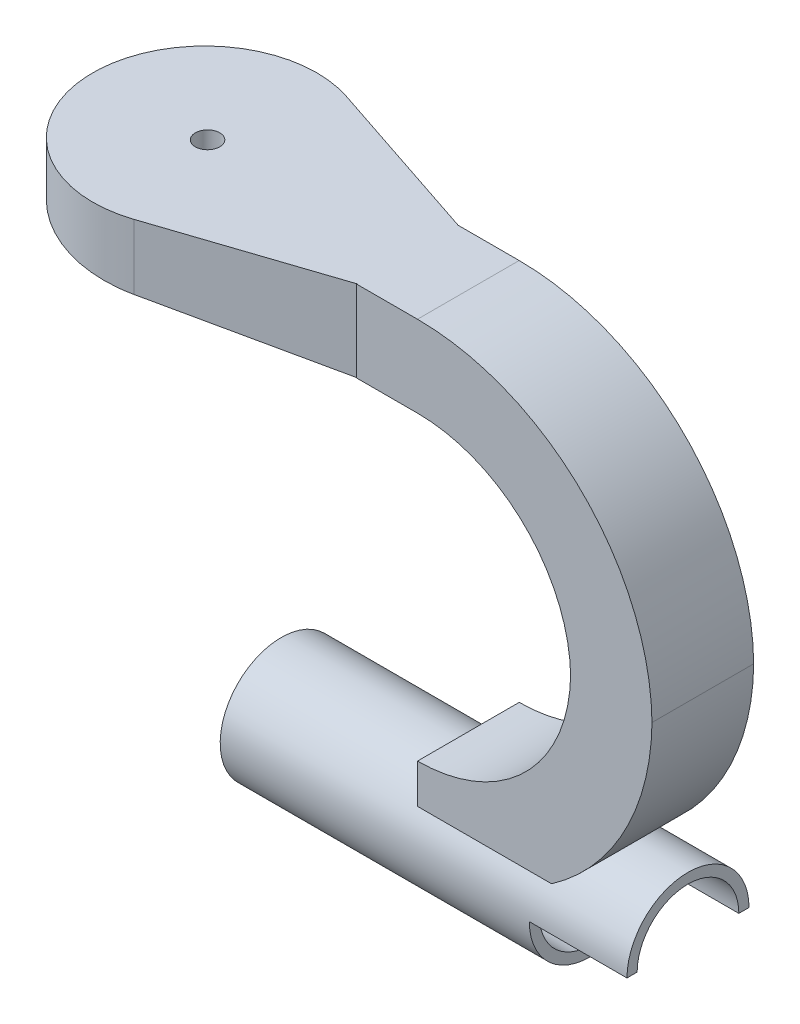
ISO-10303-21;
HEADER;
FILE_DESCRIPTION(('STEP AP214'),'2;1');
FILE_NAME('part.step','',(''),(''),'','','');
FILE_SCHEMA(('AUTOMOTIVE_DESIGN { 1 0 10303 214 1 1 1 1 }'));
ENDSEC;
DATA;
#1=APPLICATION_CONTEXT('core data for automotive mechanical design processes');
#2=APPLICATION_PROTOCOL_DEFINITION('international standard','automotive_design',2000,#1);
#3=PRODUCT_CONTEXT('',#1,'mechanical');
#4=PRODUCT('Part','Part','',(#3));
#5=PRODUCT_RELATED_PRODUCT_CATEGORY('part','',(#4));
#6=PRODUCT_DEFINITION_FORMATION('','',#4);
#7=PRODUCT_DEFINITION_CONTEXT('part definition',#1,'design');
#8=PRODUCT_DEFINITION('design','',#6,#7);
#9=PRODUCT_DEFINITION_SHAPE('','',#8);
#10=(LENGTH_UNIT() NAMED_UNIT(*) SI_UNIT(.MILLI.,.METRE.));
#11=(NAMED_UNIT(*) PLANE_ANGLE_UNIT() SI_UNIT($,.RADIAN.));
#12=(NAMED_UNIT(*) SI_UNIT($,.STERADIAN.) SOLID_ANGLE_UNIT());
#13=UNCERTAINTY_MEASURE_WITH_UNIT(LENGTH_MEASURE(1.E-05),#10,'distance_accuracy_value','');
#14=(GEOMETRIC_REPRESENTATION_CONTEXT(3) GLOBAL_UNCERTAINTY_ASSIGNED_CONTEXT((#13)) GLOBAL_UNIT_ASSIGNED_CONTEXT((#10,
#11,#12)) REPRESENTATION_CONTEXT('',''));
#15=CARTESIAN_POINT('',(0.,0.,0.));
#16=DIRECTION('',(0.,0.,1.));
#17=DIRECTION('',(1.,0.,0.));
#18=AXIS2_PLACEMENT_3D('',#15,#16,#17);
#19=CARTESIAN_POINT('',(21.9420967034581,-54.9667534375476,12.5));
#20=DIRECTION('',(-1.,0.,0.));
#21=DIRECTION('',(0.,-1.,0.));
#22=AXIS2_PLACEMENT_3D('',#19,#20,#21);
#23=CYLINDRICAL_SURFACE('',#22,15.);
#24=CARTESIAN_POINT('',(0.913116741093817,-46.6751914616591,25.));
#25=CARTESIAN_POINT('',(1.1138468792061,-46.5352621894275,24.9071761657905));
#26=CARTESIAN_POINT('',(1.3125251932372,-46.3948587290936,24.8106646041677));
#27=CARTESIAN_POINT('',(1.70552495605762,-46.1134360383374,24.6098592030103));
#28=CARTESIAN_POINT('',(1.89984559895508,-45.972416699685,24.505563939172));
#29=CARTESIAN_POINT('',(2.47655379689234,-45.5484436641558,24.1800092533691));
#30=CARTESIAN_POINT('',(2.85187772906759,-45.2651407554139,23.9464511631413));
#31=CARTESIAN_POINT('',(3.58404288105051,-44.6988301088567,23.441439431088));
#32=CARTESIAN_POINT('',(3.9406689634823,-44.4158520118274,23.1696394778224));
#33=CARTESIAN_POINT('',(4.62758378882239,-43.8580946270738,22.587611081909));
#34=CARTESIAN_POINT('',(4.95789716107535,-43.5833078265523,22.2774192864931));
#35=CARTESIAN_POINT('',(5.49809409527823,-43.1243351021247,21.7113675283263));
#36=CARTESIAN_POINT('',(5.71540088735002,-42.9367151326439,21.4653435944426));
#37=CARTESIAN_POINT('',(6.13300662272347,-42.5710308489494,20.9525266764477));
#38=CARTESIAN_POINT('',(6.33330558177778,-42.3929665258854,20.6857337115731));
#39=CARTESIAN_POINT('',(6.7145658915478,-42.0496191406402,20.1323868147486));
#40=CARTESIAN_POINT('',(6.89558377693458,-41.8842991276715,19.8458949492612));
#41=CARTESIAN_POINT('',(7.23718336341582,-41.5687021366347,19.253141280775));
#42=CARTESIAN_POINT('',(7.39776870576714,-41.4184224792662,18.9468830150244));
#43=CARTESIAN_POINT('',(7.69842642265187,-41.1342212507978,18.3123317698669));
#44=CARTESIAN_POINT('',(7.83825518907909,-41.0004966042071,17.9838343995868));
#45=CARTESIAN_POINT('',(8.0935559117688,-40.7542702904047,17.3097856201569));
#46=CARTESIAN_POINT('',(8.20902703881671,-40.6417693457318,16.9642336309053));
#47=CARTESIAN_POINT('',(8.41405052975016,-40.4406969032648,16.258749695868));
#48=CARTESIAN_POINT('',(8.50360400265006,-40.3521243815863,15.8988183661233));
#49=CARTESIAN_POINT('',(8.65549491296067,-40.2012023808026,15.1678954540618));
#50=CARTESIAN_POINT('',(8.71783750745595,-40.1388479328544,14.7969059817669));
#51=CARTESIAN_POINT('',(8.80727745227733,-40.0491600259839,14.1028834071157));
#52=CARTESIAN_POINT('',(8.83821130569222,-40.0180233208225,13.7808268853066));
#53=CARTESIAN_POINT('',(8.87927425660767,-39.9766596492437,13.1340682013829));
#54=CARTESIAN_POINT('',(8.88940568327445,-39.9664303419075,12.8093663395444));
#55=CARTESIAN_POINT('',(8.8887496838116,-39.9670919986047,12.1601716248539));
#56=CARTESIAN_POINT('',(8.87797255897424,-39.9779725621594,11.83567874783));
#57=CARTESIAN_POINT('',(8.83564392177306,-40.0206076922898,11.1894368967954));
#58=CARTESIAN_POINT('',(8.80409286274355,-40.0523618033575,10.867687863063));
#59=CARTESIAN_POINT('',(8.72365563988784,-40.133005148994,10.2530432420002));
#60=CARTESIAN_POINT('',(8.67621661293953,-40.1804608681874,9.95976724785307));
#61=CARTESIAN_POINT('',(8.56427612109732,-40.2919099310609,9.37971500891591));
#62=CARTESIAN_POINT('',(8.49977583851572,-40.3559021287875,9.0929383152313));
#63=CARTESIAN_POINT('',(8.35430221662937,-40.4993766982787,8.52758652821632));
#64=CARTESIAN_POINT('',(8.27332952328313,-40.5788584626214,8.24901111376652));
#65=CARTESIAN_POINT('',(8.09560918842098,-40.7520829684202,7.70149994927512));
#66=CARTESIAN_POINT('',(7.99886072146041,-40.8458264560833,7.43256470454019));
#67=CARTESIAN_POINT('',(7.78481578237042,-41.0515559935915,6.89148319986243));
#68=CARTESIAN_POINT('',(7.66669858406856,-41.1642483546731,6.61993072738686));
#69=CARTESIAN_POINT('',(7.41483619743397,-41.4022514086818,6.0899544746623));
#70=CARTESIAN_POINT('',(7.28109085908595,-41.5275622227324,5.83153082047167));
#71=CARTESIAN_POINT('',(6.99896033951464,-41.7891284184831,5.32848747475089));
#72=CARTESIAN_POINT('',(6.85057064067504,-41.9253871750728,5.08387207972268));
#73=CARTESIAN_POINT('',(6.54021794958831,-42.2071375972947,4.60896219467731));
#74=CARTESIAN_POINT('',(6.37825211688651,-42.3526311935245,4.37867071921562));
#75=CARTESIAN_POINT('',(5.96189951224132,-42.7221021426611,3.82675960069471));
#76=CARTESIAN_POINT('',(5.70013043080529,-42.9505574723256,3.51366484414893));
#77=CARTESIAN_POINT('',(5.15244088134756,-43.419208922037,2.91888690124005));
#78=CARTESIAN_POINT('',(4.86650936544589,-43.6594103914357,2.63721822200831));
#79=CARTESIAN_POINT('',(4.27294167759323,-44.1477048864956,2.10388754962242));
#80=CARTESIAN_POINT('',(3.96526644132582,-44.395811651897,1.85228186640155));
#81=CARTESIAN_POINT('',(3.33141358145914,-44.8957888068903,1.37820505892609));
#82=CARTESIAN_POINT('',(3.00524180262778,-45.1476579892603,1.1557248039695));
#83=CARTESIAN_POINT('',(2.38806282828078,-45.613396602158,0.770055997003427));
#84=CARTESIAN_POINT('',(2.0993591463197,-45.8271547411389,0.6030105245549));
#85=CARTESIAN_POINT('',(1.51297102917796,-46.2527207880682,0.287907136247227));
#86=CARTESIAN_POINT('',(1.21533845380558,-46.4645331072456,0.139758840673228));
#87=CARTESIAN_POINT('',(0.913116741093815,-46.6751914616591,0.));
#88=B_SPLINE_CURVE_WITH_KNOTS('',3,(#24,#25,#26,#27,#28,#29,#30,#31,#32,#33,#34,#35,#36,#37,#38,
#39,#40,#41,#42,#43,#44,#45,#46,#47,#48,#49,#50,#51,#52,#53,#54,#55,#56,#57,#58,#59,#60,#61,#62,
#63,#64,#65,#66,#67,#68,#69,#70,#71,#72,#73,#74,#75,#76,#77,#78,#79,#80,#81,#82,#83,#84,#85,#86,
#87),.UNSPECIFIED.,.F.,.F.,(4,2,2,2,2,2,2,2,2,2,2,2,2,2,2,2,2,2,2,2,2,2,2,2,2,2,2,2,2,2,2,4),
(0.,0.785044802826084,1.57023361124564,3.14376940723189,4.73260152196637,6.31992853535338,
7.45324798201158,8.58656637897864,9.71646453624466,10.8461610529694,11.9882153590478,
13.1303085381582,14.2723528399637,15.4141806041387,16.387983193098,17.3616767432498,
18.3348906927611,19.3080834052424,20.2096330909676,21.1111203173895,22.0125721991899,
22.9140712633074,23.8636527633375,24.8132433791969,25.7631278539802,26.7132115659628,
28.1141840634469,29.5158006351927,30.9200026834323,32.3237634605156,33.5117030621032,
34.6937291602976),.UNSPECIFIED.);
#89=CARTESIAN_POINT('',(0.913116741093817,-46.6751914616591,25.));
#90=VERTEX_POINT('',#89);
#91=CARTESIAN_POINT('',(0.913116741093824,-46.6751914616591,0.));
#92=VERTEX_POINT('',#91);
#93=EDGE_CURVE('E322',#90,#92,#88,.T.);
#94=ORIENTED_EDGE('',*,*,#93,.F.);
#95=DIRECTION('',(-1.,0.,0.));
#96=VECTOR('',#95,1.);
#97=CARTESIAN_POINT('',(21.9420967034581,-46.6751914616591,25.));
#98=LINE('',#97,#96);
#99=CARTESIAN_POINT('',(-32.0579032965419,-46.6751914616591,25.));
#100=VERTEX_POINT('',#99);
#101=EDGE_CURVE('E331',#90,#100,#98,.T.);
#102=ORIENTED_EDGE('',*,*,#101,.T.);
#103=CARTESIAN_POINT('',(-32.0579032965419,-54.9667534375476,12.5));
#104=DIRECTION('',(1.,0.,0.));
#105=DIRECTION('',(0.,1.,0.));
#106=AXIS2_PLACEMENT_3D('',#103,#104,#105);
#107=CIRCLE('',#106,15.);
#108=CARTESIAN_POINT('',(-32.0579032965419,-46.6751914616591,0.));
#109=VERTEX_POINT('',#108);
#110=EDGE_CURVE('E318',#109,#100,#107,.T.);
#111=ORIENTED_EDGE('',*,*,#110,.F.);
#112=DIRECTION('',(-1.,0.,0.));
#113=VECTOR('',#112,1.);
#114=CARTESIAN_POINT('',(21.9420967034581,-46.6751914616591,0.));
#115=LINE('',#114,#113);
#116=EDGE_CURVE('E456',#92,#109,#115,.T.);
#117=ORIENTED_EDGE('',*,*,#116,.F.);
#118=EDGE_LOOP('',(#94,#102,#111,#117));
#119=FACE_BOUND('',#118,.T.);
#120=CARTESIAN_POINT('',(-78.0579032965419,-54.9667534375476,12.5));
#121=DIRECTION('',(-1.,0.,0.));
#122=DIRECTION('',(0.,-1.,0.));
#123=AXIS2_PLACEMENT_3D('',#120,#121,#122);
#124=CIRCLE('',#123,15.);
#125=CARTESIAN_POINT('',(-78.0579032965419,-69.9667534375476,12.5));
#126=VERTEX_POINT('',#125);
#127=EDGE_CURVE('E307',#126,#126,#124,.T.);
#128=ORIENTED_EDGE('',*,*,#127,.F.);
#129=EDGE_LOOP('',(#128));
#130=FACE_BOUND('',#129,.T.);
#131=CARTESIAN_POINT('',(21.9420967034581,-54.9667534375476,12.5));
#132=DIRECTION('',(-1.,0.,0.));
#133=DIRECTION('',(0.,-1.,0.));
#134=AXIS2_PLACEMENT_3D('',#131,#132,#133);
#135=CIRCLE('',#134,15.);
#136=CARTESIAN_POINT('',(21.9420967034581,-54.9667534375476,27.5));
#137=VERTEX_POINT('',#136);
#138=CARTESIAN_POINT('',(21.9420967034581,-54.9667534375476,-2.49999999999999));
#139=VERTEX_POINT('',#138);
#140=EDGE_CURVE('E314',#137,#139,#135,.T.);
#141=ORIENTED_EDGE('',*,*,#140,.T.);
#142=DIRECTION('',(1.,0.,0.));
#143=VECTOR('',#142,1.);
#144=CARTESIAN_POINT('',(-2.05790329654187,-54.9667534375476,-2.49999999999999));
#145=LINE('',#144,#143);
#146=CARTESIAN_POINT('',(-2.05790329654187,-54.9667534375476,-2.49999999999999));
#147=VERTEX_POINT('',#146);
#148=EDGE_CURVE('E277',#147,#139,#145,.T.);
#149=ORIENTED_EDGE('',*,*,#148,.F.);
#150=CARTESIAN_POINT('',(-2.05790329654187,-54.9667534375476,12.5));
#151=DIRECTION('',(1.,0.,0.));
#152=DIRECTION('',(0.,1.,0.));
#153=AXIS2_PLACEMENT_3D('',#150,#151,#152);
#154=CIRCLE('',#153,15.);
#155=CARTESIAN_POINT('',(-2.05790329654187,-54.9667534375476,27.5));
#156=VERTEX_POINT('',#155);
#157=EDGE_CURVE('E260',#156,#147,#154,.T.);
#158=ORIENTED_EDGE('',*,*,#157,.F.);
#159=DIRECTION('',(1.,0.,0.));
#160=VECTOR('',#159,1.);
#161=CARTESIAN_POINT('',(-2.05790329654187,-54.9667534375476,27.5));
#162=LINE('',#161,#160);
#163=EDGE_CURVE('E280',#156,#137,#162,.T.);
#164=ORIENTED_EDGE('',*,*,#163,.T.);
#165=EDGE_LOOP('',(#141,#149,#158,#164));
#166=FACE_BOUND('',#165,.T.);
#167=ADVANCED_FACE('F41',(#119,#130,#166),#23,.T.);
#168=CARTESIAN_POINT('',(21.9420967034581,-54.9667534375476,12.5));
#169=DIRECTION('',(-1.,0.,0.));
#170=DIRECTION('',(0.,-1.,0.));
#171=AXIS2_PLACEMENT_3D('',#168,#169,#170);
#172=PLANE('',#171);
#173=DIRECTION('',(0.,0.,-1.));
#174=VECTOR('',#173,1.);
#175=CARTESIAN_POINT('',(21.9420967034581,-54.9667534375476,0.));
#176=LINE('',#175,#174);
#177=CARTESIAN_POINT('',(21.9420967034581,-54.9667534375476,0.));
#178=VERTEX_POINT('',#177);
#179=EDGE_CURVE('E256',#178,#139,#176,.T.);
#180=ORIENTED_EDGE('',*,*,#179,.T.);
#181=ORIENTED_EDGE('',*,*,#140,.F.);
#182=DIRECTION('',(0.,0.,1.));
#183=VECTOR('',#182,1.);
#184=CARTESIAN_POINT('',(21.9420967034581,-54.9667534375476,0.));
#185=LINE('',#184,#183);
#186=CARTESIAN_POINT('',(21.9420967034581,-54.9667534375476,25.));
#187=VERTEX_POINT('',#186);
#188=EDGE_CURVE('E268',#187,#137,#185,.T.);
#189=ORIENTED_EDGE('',*,*,#188,.F.);
#190=CARTESIAN_POINT('',(21.9420967034581,-54.9667534375476,12.5));
#191=DIRECTION('',(1.,0.,0.));
#192=DIRECTION('',(0.,1.,0.));
#193=AXIS2_PLACEMENT_3D('',#190,#191,#192);
#194=CIRCLE('',#193,12.5);
#195=EDGE_CURVE('E302',#178,#187,#194,.T.);
#196=ORIENTED_EDGE('',*,*,#195,.F.);
#197=EDGE_LOOP('',(#180,#181,#189,#196));
#198=FACE_BOUND('',#197,.T.);
#199=ADVANCED_FACE('F337',(#198),#172,.F.);
#200=CARTESIAN_POINT('',(-73.0579032965419,-54.9667534375476,12.5));
#201=DIRECTION('',(1.,0.,0.));
#202=DIRECTION('',(0.,1.,0.));
#203=AXIS2_PLACEMENT_3D('',#200,#201,#202);
#204=CYLINDRICAL_SURFACE('',#203,12.5);
#205=CARTESIAN_POINT('',(-73.0579032965419,-54.9667534375476,12.5));
#206=DIRECTION('',(1.,0.,0.));
#207=DIRECTION('',(0.,1.,0.));
#208=AXIS2_PLACEMENT_3D('',#205,#206,#207);
#209=CIRCLE('',#208,12.5);
#210=CARTESIAN_POINT('',(-73.0579032965419,-42.4667534375476,12.5));
#211=VERTEX_POINT('',#210);
#212=EDGE_CURVE('E303',#211,#211,#209,.T.);
#213=ORIENTED_EDGE('',*,*,#212,.F.);
#214=EDGE_LOOP('',(#213));
#215=FACE_BOUND('',#214,.T.);
#216=DIRECTION('',(1.,0.,0.));
#217=VECTOR('',#216,1.);
#218=CARTESIAN_POINT('',(-2.05790329654187,-54.9667534375476,0.));
#219=LINE('',#218,#217);
#220=CARTESIAN_POINT('',(-2.05790329654187,-54.9667534375476,0.));
#221=VERTEX_POINT('',#220);
#222=EDGE_CURVE('E67',#221,#178,#219,.T.);
#223=ORIENTED_EDGE('',*,*,#222,.T.);
#224=ORIENTED_EDGE('',*,*,#195,.T.);
#225=DIRECTION('',(1.,0.,0.));
#226=VECTOR('',#225,1.);
#227=CARTESIAN_POINT('',(-2.05790329654187,-54.9667534375476,25.));
#228=LINE('',#227,#226);
#229=CARTESIAN_POINT('',(-2.05790329654187,-54.9667534375476,25.));
#230=VERTEX_POINT('',#229);
#231=EDGE_CURVE('E267',#230,#187,#228,.T.);
#232=ORIENTED_EDGE('',*,*,#231,.F.);
#233=CARTESIAN_POINT('',(-2.05790329654187,-54.9667534375476,12.5));
#234=DIRECTION('',(1.,0.,0.));
#235=DIRECTION('',(0.,1.,0.));
#236=AXIS2_PLACEMENT_3D('',#233,#234,#235);
#237=CIRCLE('',#236,12.5);
#238=EDGE_CURVE('E251',#230,#221,#237,.T.);
#239=ORIENTED_EDGE('',*,*,#238,.T.);
#240=EDGE_LOOP('',(#223,#224,#232,#239));
#241=FACE_BOUND('',#240,.T.);
#242=ADVANCED_FACE('F381',(#215,#241),#204,.F.);
#243=CARTESIAN_POINT('',(-47.0579032965419,0.,25.));
#244=DIRECTION('',(1.,0.,0.));
#245=DIRECTION('',(0.,0.,-1.));
#246=AXIS2_PLACEMENT_3D('',#243,#244,#245);
#247=PLANE('',#246);
#248=DIRECTION('',(0.,1.,0.));
#249=VECTOR('',#248,1.);
#250=CARTESIAN_POINT('',(-47.0579032965419,37.0332465624524,24.9012426426025));
#251=LINE('',#250,#249);
#252=CARTESIAN_POINT('',(-47.0579032965419,37.0332465624524,24.9012426426025));
#253=VERTEX_POINT('',#252);
#254=CARTESIAN_POINT('',(-47.0579032965419,57.0332465624524,24.9012426426025));
#255=VERTEX_POINT('',#254);
#256=EDGE_CURVE('E411',#253,#255,#251,.T.);
#257=ORIENTED_EDGE('',*,*,#256,.F.);
#258=DIRECTION('',(0.,0.,-1.));
#259=VECTOR('',#258,1.);
#260=CARTESIAN_POINT('',(-47.0579032965419,37.0332465624524,25.));
#261=LINE('',#260,#259);
#262=CARTESIAN_POINT('',(-47.0579032965419,37.0332465624524,25.));
#263=VERTEX_POINT('',#262);
#264=EDGE_CURVE('E445',#263,#253,#261,.T.);
#265=ORIENTED_EDGE('',*,*,#264,.F.);
#266=DIRECTION('',(0.,-1.,0.));
#267=VECTOR('',#266,1.);
#268=CARTESIAN_POINT('',(-47.0579032965419,0.,25.));
#269=LINE('',#268,#267);
#270=CARTESIAN_POINT('',(-47.0579032965419,57.0332465624524,25.));
#271=VERTEX_POINT('',#270);
#272=EDGE_CURVE('E801',#271,#263,#269,.T.);
#273=ORIENTED_EDGE('',*,*,#272,.F.);
#274=DIRECTION('',(0.,0.,-1.));
#275=VECTOR('',#274,1.);
#276=CARTESIAN_POINT('',(-47.0579032965419,57.0332465624524,25.));
#277=LINE('',#276,#275);
#278=EDGE_CURVE('E449',#271,#255,#277,.T.);
#279=ORIENTED_EDGE('',*,*,#278,.T.);
#280=EDGE_LOOP('',(#257,#265,#273,#279));
#281=FACE_BOUND('',#280,.T.);
#282=ADVANCED_FACE('F378',(#281),#247,.F.);
#283=CARTESIAN_POINT('',(-32.0579032965419,0.621277195669455,25.));
#284=DIRECTION('',(0.,0.,-1.));
#285=DIRECTION('',(-1.,0.,0.));
#286=AXIS2_PLACEMENT_3D('',#283,#284,#285);
#287=CYLINDRICAL_SURFACE('',#286,57.6545237581219);
#288=CARTESIAN_POINT('',(-32.0579032965419,0.621277195669455,25.));
#289=DIRECTION('',(0.,0.,1.));
#290=DIRECTION('',(1.,0.,0.));
#291=AXIS2_PLACEMENT_3D('',#288,#289,#290);
#292=CIRCLE('',#291,57.6545237581219);
#293=CARTESIAN_POINT('',(25.5932729657165,0.,25.));
#294=VERTEX_POINT('',#293);
#295=EDGE_CURVE('E434',#90,#294,#292,.T.);
#296=ORIENTED_EDGE('',*,*,#295,.F.);
#297=ORIENTED_EDGE('',*,*,#93,.T.);
#298=CARTESIAN_POINT('',(-32.0579032965419,0.621277195669455,0.));
#299=DIRECTION('',(0.,0.,1.));
#300=DIRECTION('',(1.,0.,0.));
#301=AXIS2_PLACEMENT_3D('',#298,#299,#300);
#302=CIRCLE('',#301,57.6545237581219);
#303=CARTESIAN_POINT('',(25.5932729657165,0.,0.));
#304=VERTEX_POINT('',#303);
#305=EDGE_CURVE('E405',#92,#304,#302,.T.);
#306=ORIENTED_EDGE('',*,*,#305,.T.);
#307=DIRECTION('',(0.,0.,-1.));
#308=VECTOR('',#307,1.);
#309=CARTESIAN_POINT('',(25.5932729657165,0.,25.));
#310=LINE('',#309,#308);
#311=EDGE_CURVE('E400',#294,#304,#310,.T.);
#312=ORIENTED_EDGE('',*,*,#311,.F.);
#313=EDGE_LOOP('',(#296,#297,#306,#312));
#314=FACE_BOUND('',#313,.T.);
#315=ADVANCED_FACE('F43',(#314),#287,.T.);
#316=CARTESIAN_POINT('',(-32.0579032965419,-0.621277195669455,25.));
#317=DIRECTION('',(0.,0.,-1.));
#318=DIRECTION('',(-1.,0.,0.));
#319=AXIS2_PLACEMENT_3D('',#316,#317,#318);
#320=CYLINDRICAL_SURFACE('',#319,57.6545237581219);
#321=CARTESIAN_POINT('',(-32.0579032965419,-0.621277195669455,0.));
#322=DIRECTION('',(0.,0.,1.));
#323=DIRECTION('',(1.,0.,0.));
#324=AXIS2_PLACEMENT_3D('',#321,#322,#323);
#325=CIRCLE('',#324,57.6545237581219);
#326=CARTESIAN_POINT('',(-32.0579032965419,57.0332465624524,0.));
#327=VERTEX_POINT('',#326);
#328=EDGE_CURVE('E395',#327,#304,#325,.F.);
#329=ORIENTED_EDGE('',*,*,#328,.F.);
#330=DIRECTION('',(0.,0.,-1.));
#331=VECTOR('',#330,1.);
#332=CARTESIAN_POINT('',(-32.0579032965419,57.0332465624524,25.));
#333=LINE('',#332,#331);
#334=CARTESIAN_POINT('',(-32.0579032965419,57.0332465624524,25.));
#335=VERTEX_POINT('',#334);
#336=EDGE_CURVE('E397',#335,#327,#333,.T.);
#337=ORIENTED_EDGE('',*,*,#336,.F.);
#338=CARTESIAN_POINT('',(-32.0579032965419,-0.621277195669455,25.));
#339=DIRECTION('',(0.,0.,1.));
#340=DIRECTION('',(1.,0.,0.));
#341=AXIS2_PLACEMENT_3D('',#338,#339,#340);
#342=CIRCLE('',#341,57.6545237581219);
#343=EDGE_CURVE('E795',#335,#294,#342,.F.);
#344=ORIENTED_EDGE('',*,*,#343,.T.);
#345=ORIENTED_EDGE('',*,*,#311,.T.);
#346=EDGE_LOOP('',(#329,#337,#344,#345));
#347=FACE_BOUND('',#346,.T.);
#348=ADVANCED_FACE('F384',(#347),#320,.T.);
#349=CARTESIAN_POINT('',(0.,57.0332465624524,25.));
#350=DIRECTION('',(0.,-1.,0.));
#351=DIRECTION('',(0.,0.,-1.));
#352=AXIS2_PLACEMENT_3D('',#349,#350,#351);
#353=PLANE('',#352);
#354=CARTESIAN_POINT('',(-96.0521930019734,57.0332465624524,12.6061021043496));
#355=DIRECTION('',(0.,1.,0.));
#356=DIRECTION('',(0.,0.,1.));
#357=AXIS2_PLACEMENT_3D('',#354,#355,#356);
#358=CIRCLE('',#357,3.00000000000001);
#359=CARTESIAN_POINT('',(-96.0521930019734,57.0332465624524,15.6061021043496));
#360=VERTEX_POINT('',#359);
#361=EDGE_CURVE('E298',#360,#360,#358,.T.);
#362=ORIENTED_EDGE('',*,*,#361,.F.);
#363=EDGE_LOOP('',(#362));
#364=FACE_BOUND('',#363,.T.);
#365=DIRECTION('',(-1.,0.,0.));
#366=VECTOR('',#365,1.);
#367=CARTESIAN_POINT('',(0.,57.0332465624524,0.));
#368=LINE('',#367,#366);
#369=CARTESIAN_POINT('',(-47.0579032965419,57.0332465624524,0.));
#370=VERTEX_POINT('',#369);
#371=EDGE_CURVE('E404',#327,#370,#368,.T.);
#372=ORIENTED_EDGE('',*,*,#371,.T.);
#373=DIRECTION('',(-0.948821293671373,0.,-0.315813477666458));
#374=VECTOR('',#373,1.);
#375=CARTESIAN_POINT('',(-47.0579032965419,57.0332465624524,0.));
#376=LINE('',#375,#374);
#377=CARTESIAN_POINT('',(-88.1888610392089,57.0332465624524,-13.6903660268851));
#378=VERTEX_POINT('',#377);
#379=EDGE_CURVE('E768',#370,#378,#376,.T.);
#380=ORIENTED_EDGE('',*,*,#379,.T.);
#381=CARTESIAN_POINT('',(-96.8898421187134,57.0332465624524,12.4506213213013));
#382=DIRECTION('',(0.,1.,0.));
#383=DIRECTION('',(0.,0.,1.));
#384=AXIS2_PLACEMENT_3D('',#381,#382,#383);
#385=CIRCLE('',#384,27.5510125273816);
#386=CARTESIAN_POINT('',(-88.1888610392089,57.0332465624524,38.5916086694876));
#387=VERTEX_POINT('',#386);
#388=EDGE_CURVE('E776',#378,#387,#385,.T.);
#389=ORIENTED_EDGE('',*,*,#388,.T.);
#390=DIRECTION('',(0.948821293671373,0.,-0.315813477666457));
#391=VECTOR('',#390,1.);
#392=CARTESIAN_POINT('',(-88.1888610392089,57.0332465624524,38.5916086694876));
#393=LINE('',#392,#391);
#394=EDGE_CURVE('E779',#387,#255,#393,.T.);
#395=ORIENTED_EDGE('',*,*,#394,.T.);
#396=ORIENTED_EDGE('',*,*,#278,.F.);
#397=DIRECTION('',(-1.,0.,0.));
#398=VECTOR('',#397,1.);
#399=CARTESIAN_POINT('',(0.,57.0332465624524,25.));
#400=LINE('',#399,#398);
#401=EDGE_CURVE('E798',#335,#271,#400,.T.);
#402=ORIENTED_EDGE('',*,*,#401,.F.);
#403=ORIENTED_EDGE('',*,*,#336,.T.);
#404=EDGE_LOOP('',(#372,#380,#389,#395,#396,#402,#403));
#405=FACE_BOUND('',#404,.T.);
#406=ADVANCED_FACE('F376',(#364,#405),#353,.F.);
#407=CARTESIAN_POINT('',(0.,37.0332465624524,25.));
#408=DIRECTION('',(0.,-1.,0.));
#409=DIRECTION('',(1.,0.,0.));
#410=AXIS2_PLACEMENT_3D('',#407,#408,#409);
#411=PLANE('',#410);
#412=DIRECTION('',(0.,0.,1.));
#413=VECTOR('',#412,1.);
#414=CARTESIAN_POINT('',(-47.0579032965419,37.0332465624524,-15.1003912060803));
#415=LINE('',#414,#413);
#416=CARTESIAN_POINT('',(-47.0579032965419,37.0332465624524,0.));
#417=VERTEX_POINT('',#416);
#418=EDGE_CURVE('E276',#417,#253,#415,.T.);
#419=ORIENTED_EDGE('',*,*,#418,.F.);
#420=DIRECTION('',(-1.,0.,0.));
#421=VECTOR('',#420,1.);
#422=CARTESIAN_POINT('',(0.,37.0332465624524,0.));
#423=LINE('',#422,#421);
#424=CARTESIAN_POINT('',(-32.0579032965419,37.0332465624524,0.));
#425=VERTEX_POINT('',#424);
#426=EDGE_CURVE('E418',#425,#417,#423,.T.);
#427=ORIENTED_EDGE('',*,*,#426,.F.);
#428=DIRECTION('',(0.,0.,-1.));
#429=VECTOR('',#428,1.);
#430=CARTESIAN_POINT('',(-32.0579032965419,37.0332465624524,25.));
#431=LINE('',#430,#429);
#432=CARTESIAN_POINT('',(-32.0579032965419,37.0332465624524,25.));
#433=VERTEX_POINT('',#432);
#434=EDGE_CURVE('E442',#433,#425,#431,.T.);
#435=ORIENTED_EDGE('',*,*,#434,.F.);
#436=DIRECTION('',(-1.,0.,0.));
#437=VECTOR('',#436,1.);
#438=CARTESIAN_POINT('',(0.,37.0332465624524,25.));
#439=LINE('',#438,#437);
#440=EDGE_CURVE('E804',#433,#263,#439,.T.);
#441=ORIENTED_EDGE('',*,*,#440,.T.);
#442=ORIENTED_EDGE('',*,*,#264,.T.);
#443=EDGE_LOOP('',(#419,#427,#435,#441,#442));
#444=FACE_BOUND('',#443,.T.);
#445=ADVANCED_FACE('F372',(#444),#411,.T.);
#446=CARTESIAN_POINT('',(-32.0579032965419,-0.621277195669455,25.));
#447=DIRECTION('',(0.,0.,-1.));
#448=DIRECTION('',(-1.,0.,0.));
#449=AXIS2_PLACEMENT_3D('',#446,#447,#448);
#450=CYLINDRICAL_SURFACE('',#449,37.6545237581219);
#451=CARTESIAN_POINT('',(-32.0579032965419,-0.621277195669455,0.));
#452=DIRECTION('',(0.,0.,1.));
#453=DIRECTION('',(1.,0.,0.));
#454=AXIS2_PLACEMENT_3D('',#451,#452,#453);
#455=CIRCLE('',#454,37.6545237581219);
#456=CARTESIAN_POINT('',(5.59149476102478,0.,0.));
#457=VERTEX_POINT('',#456);
#458=EDGE_CURVE('E422',#425,#457,#455,.F.);
#459=ORIENTED_EDGE('',*,*,#458,.T.);
#460=DIRECTION('',(0.,0.,-1.));
#461=VECTOR('',#460,1.);
#462=CARTESIAN_POINT('',(5.59149476102478,0.,25.));
#463=LINE('',#462,#461);
#464=CARTESIAN_POINT('',(5.59149476102478,0.,25.));
#465=VERTEX_POINT('',#464);
#466=EDGE_CURVE('E438',#465,#457,#463,.T.);
#467=ORIENTED_EDGE('',*,*,#466,.F.);
#468=CARTESIAN_POINT('',(-32.0579032965419,-0.621277195669455,25.));
#469=DIRECTION('',(0.,0.,1.));
#470=DIRECTION('',(1.,0.,0.));
#471=AXIS2_PLACEMENT_3D('',#468,#469,#470);
#472=CIRCLE('',#471,37.6545237581219);
#473=EDGE_CURVE('E808',#433,#465,#472,.F.);
#474=ORIENTED_EDGE('',*,*,#473,.F.);
#475=ORIENTED_EDGE('',*,*,#434,.T.);
#476=EDGE_LOOP('',(#459,#467,#474,#475));
#477=FACE_BOUND('',#476,.T.);
#478=ADVANCED_FACE('F368',(#477),#450,.F.);
#479=CARTESIAN_POINT('',(-32.0579032965419,0.621277195669455,25.));
#480=DIRECTION('',(0.,0.,-1.));
#481=DIRECTION('',(-1.,0.,0.));
#482=AXIS2_PLACEMENT_3D('',#479,#480,#481);
#483=CYLINDRICAL_SURFACE('',#482,37.6545237581219);
#484=CARTESIAN_POINT('',(-32.0579032965419,0.621277195669455,0.));
#485=DIRECTION('',(0.,0.,1.));
#486=DIRECTION('',(1.,0.,0.));
#487=AXIS2_PLACEMENT_3D('',#484,#485,#486);
#488=CIRCLE('',#487,37.6545237581219);
#489=CARTESIAN_POINT('',(-32.0579032965419,-37.0332465624524,0.));
#490=VERTEX_POINT('',#489);
#491=EDGE_CURVE('E426',#490,#457,#488,.T.);
#492=ORIENTED_EDGE('',*,*,#491,.F.);
#493=DIRECTION('',(0.,0.,-1.));
#494=VECTOR('',#493,1.);
#495=CARTESIAN_POINT('',(-32.0579032965419,-37.0332465624524,25.));
#496=LINE('',#495,#494);
#497=CARTESIAN_POINT('',(-32.0579032965419,-37.0332465624524,25.));
#498=VERTEX_POINT('',#497);
#499=EDGE_CURVE('E435',#498,#490,#496,.T.);
#500=ORIENTED_EDGE('',*,*,#499,.F.);
#501=CARTESIAN_POINT('',(-32.0579032965419,0.621277195669455,25.));
#502=DIRECTION('',(0.,0.,1.));
#503=DIRECTION('',(1.,0.,0.));
#504=AXIS2_PLACEMENT_3D('',#501,#502,#503);
#505=CIRCLE('',#504,37.6545237581219);
#506=EDGE_CURVE('E811',#498,#465,#505,.T.);
#507=ORIENTED_EDGE('',*,*,#506,.T.);
#508=ORIENTED_EDGE('',*,*,#466,.T.);
#509=EDGE_LOOP('',(#492,#500,#507,#508));
#510=FACE_BOUND('',#509,.T.);
#511=ADVANCED_FACE('F364',(#510),#483,.F.);
#512=CARTESIAN_POINT('',(-32.0579032965419,0.,25.));
#513=DIRECTION('',(1.,0.,0.));
#514=DIRECTION('',(0.,1.,0.));
#515=AXIS2_PLACEMENT_3D('',#512,#513,#514);
#516=PLANE('',#515);
#517=DIRECTION('',(0.,-1.,0.));
#518=VECTOR('',#517,1.);
#519=CARTESIAN_POINT('',(-32.0579032965419,0.,0.));
#520=LINE('',#519,#518);
#521=EDGE_CURVE('E430',#490,#109,#520,.T.);
#522=ORIENTED_EDGE('',*,*,#521,.T.);
#523=ORIENTED_EDGE('',*,*,#110,.T.);
#524=DIRECTION('',(0.,-1.,0.));
#525=VECTOR('',#524,1.);
#526=CARTESIAN_POINT('',(-32.0579032965419,0.,25.));
#527=LINE('',#526,#525);
#528=EDGE_CURVE('E439',#498,#100,#527,.T.);
#529=ORIENTED_EDGE('',*,*,#528,.F.);
#530=ORIENTED_EDGE('',*,*,#499,.T.);
#531=EDGE_LOOP('',(#522,#523,#529,#530));
#532=FACE_BOUND('',#531,.T.);
#533=ADVANCED_FACE('F357',(#532),#516,.F.);
#534=CARTESIAN_POINT('',(0.,0.,25.));
#535=DIRECTION('',(0.,0.,1.));
#536=DIRECTION('',(1.,0.,0.));
#537=AXIS2_PLACEMENT_3D('',#534,#535,#536);
#538=PLANE('',#537);
#539=ORIENTED_EDGE('',*,*,#101,.F.);
#540=ORIENTED_EDGE('',*,*,#295,.T.);
#541=ORIENTED_EDGE('',*,*,#343,.F.);
#542=ORIENTED_EDGE('',*,*,#401,.T.);
#543=ORIENTED_EDGE('',*,*,#272,.T.);
#544=ORIENTED_EDGE('',*,*,#440,.F.);
#545=ORIENTED_EDGE('',*,*,#473,.T.);
#546=ORIENTED_EDGE('',*,*,#506,.F.);
#547=ORIENTED_EDGE('',*,*,#528,.T.);
#548=EDGE_LOOP('',(#539,#540,#541,#542,#543,#544,#545,#546,#547));
#549=FACE_BOUND('',#548,.T.);
#550=ADVANCED_FACE('F354',(#549),#538,.T.);
#551=CARTESIAN_POINT('',(0.,0.,0.));
#552=DIRECTION('',(0.,0.,1.));
#553=DIRECTION('',(1.,0.,0.));
#554=AXIS2_PLACEMENT_3D('',#551,#552,#553);
#555=PLANE('',#554);
#556=ORIENTED_EDGE('',*,*,#305,.F.);
#557=ORIENTED_EDGE('',*,*,#116,.T.);
#558=ORIENTED_EDGE('',*,*,#521,.F.);
#559=ORIENTED_EDGE('',*,*,#491,.T.);
#560=ORIENTED_EDGE('',*,*,#458,.F.);
#561=ORIENTED_EDGE('',*,*,#426,.T.);
#562=DIRECTION('',(0.,-1.,0.));
#563=VECTOR('',#562,1.);
#564=CARTESIAN_POINT('',(-47.0579032965419,0.,0.));
#565=LINE('',#564,#563);
#566=EDGE_CURVE('E409',#370,#417,#565,.T.);
#567=ORIENTED_EDGE('',*,*,#566,.F.);
#568=ORIENTED_EDGE('',*,*,#371,.F.);
#569=ORIENTED_EDGE('',*,*,#328,.T.);
#570=EDGE_LOOP('',(#556,#557,#558,#559,#560,#561,#567,#568,#569));
#571=FACE_BOUND('',#570,.T.);
#572=ADVANCED_FACE('F352',(#571),#555,.F.);
#573=CARTESIAN_POINT('',(-47.0579032965419,37.0332465624524,0.));
#574=DIRECTION('',(0.315813477666458,0.,-0.948821293671373));
#575=DIRECTION('',(-0.948821293671373,0.,-0.315813477666457));
#576=AXIS2_PLACEMENT_3D('',#573,#574,#575);
#577=PLANE('',#576);
#578=DIRECTION('',(0.944793800143109,-0.0920404760541468,0.314472933618886));
#579=VECTOR('',#578,1.);
#580=CARTESIAN_POINT('',(-47.0579032965419,37.0332465624524,0.));
#581=LINE('',#580,#579);
#582=CARTESIAN_POINT('',(-88.1888610392089,41.0401663058129,-13.6903660268851));
#583=VERTEX_POINT('',#582);
#584=EDGE_CURVE('E292',#583,#417,#581,.T.);
#585=ORIENTED_EDGE('',*,*,#584,.F.);
#586=DIRECTION('',(0.,1.,0.));
#587=VECTOR('',#586,1.);
#588=CARTESIAN_POINT('',(-88.1888610392089,37.0332465624524,-13.6903660268851));
#589=LINE('',#588,#587);
#590=EDGE_CURVE('E773',#583,#378,#589,.T.);
#591=ORIENTED_EDGE('',*,*,#590,.T.);
#592=ORIENTED_EDGE('',*,*,#379,.F.);
#593=ORIENTED_EDGE('',*,*,#566,.T.);
#594=EDGE_LOOP('',(#585,#591,#592,#593));
#595=FACE_BOUND('',#594,.T.);
#596=ADVANCED_FACE('F344',(#595),#577,.T.);
#597=CARTESIAN_POINT('',(-88.1888610392089,37.0332465624524,38.5916086694876));
#598=DIRECTION('',(0.315813477666457,0.,0.948821293671373));
#599=DIRECTION('',(0.948821293671373,0.,-0.315813477666457));
#600=AXIS2_PLACEMENT_3D('',#597,#598,#599);
#601=PLANE('',#600);
#602=DIRECTION('',(-0.94479380014311,0.0920404760541468,0.314472933618886));
#603=VECTOR('',#602,1.);
#604=CARTESIAN_POINT('',(-87.8404222188171,41.0062218886293,38.4756314287196));
#605=LINE('',#604,#603);
#606=CARTESIAN_POINT('',(-88.1888610392089,41.0401663058129,38.5916086694876));
#607=VERTEX_POINT('',#606);
#608=EDGE_CURVE('E288',#253,#607,#605,.T.);
#609=ORIENTED_EDGE('',*,*,#608,.F.);
#610=ORIENTED_EDGE('',*,*,#256,.T.);
#611=ORIENTED_EDGE('',*,*,#394,.F.);
#612=DIRECTION('',(0.,1.,0.));
#613=VECTOR('',#612,1.);
#614=CARTESIAN_POINT('',(-88.1888610392089,37.0332465624524,38.5916086694876));
#615=LINE('',#614,#613);
#616=EDGE_CURVE('E788',#607,#387,#615,.T.);
#617=ORIENTED_EDGE('',*,*,#616,.F.);
#618=EDGE_LOOP('',(#609,#610,#611,#617));
#619=FACE_BOUND('',#618,.T.);
#620=ADVANCED_FACE('F340',(#619),#601,.T.);
#621=CARTESIAN_POINT('',(-96.8898421187134,37.0332465624524,12.4506213213013));
#622=DIRECTION('',(0.,1.,0.));
#623=DIRECTION('',(0.,0.,1.));
#624=AXIS2_PLACEMENT_3D('',#621,#622,#623);
#625=CYLINDRICAL_SURFACE('',#624,27.5510125273816);
#626=CARTESIAN_POINT('',(-96.8898421187134,41.8878035792311,12.4506213213013));
#627=DIRECTION('',(0.096959580767123,0.995288319883974,0.));
#628=DIRECTION('',(-0.995288319883974,0.096959580767123,0.));
#629=AXIS2_PLACEMENT_3D('',#626,#627,#628);
#630=ELLIPSE('',#629,27.6814386112693,27.5510125273816);
#631=EDGE_CURVE('E289',#607,#583,#630,.F.);
#632=ORIENTED_EDGE('',*,*,#631,.F.);
#633=ORIENTED_EDGE('',*,*,#616,.T.);
#634=ORIENTED_EDGE('',*,*,#388,.F.);
#635=ORIENTED_EDGE('',*,*,#590,.F.);
#636=EDGE_LOOP('',(#632,#633,#634,#635));
#637=FACE_BOUND('',#636,.T.);
#638=ADVANCED_FACE('F343',(#637),#625,.T.);
#639=CARTESIAN_POINT('',(-78.0579032965419,-54.9667534375476,12.5));
#640=DIRECTION('',(-1.,0.,0.));
#641=DIRECTION('',(0.,-1.,0.));
#642=AXIS2_PLACEMENT_3D('',#639,#640,#641);
#643=PLANE('',#642);
#644=CARTESIAN_POINT('',(-78.0579032965419,-59.1684822131461,14.6721821508123));
#645=DIRECTION('',(-1.,0.,0.));
#646=DIRECTION('',(0.,-1.,0.));
#647=AXIS2_PLACEMENT_3D('',#644,#645,#646);
#648=CIRCLE('',#647,2.435);
#649=CARTESIAN_POINT('',(-78.0579032965419,-61.6034822131461,14.6721821508123));
#650=VERTEX_POINT('',#649);
#651=EDGE_CURVE('E246',#650,#650,#648,.T.);
#652=ORIENTED_EDGE('',*,*,#651,.F.);
#653=EDGE_LOOP('',(#652));
#654=FACE_BOUND('',#653,.T.);
#655=ORIENTED_EDGE('',*,*,#127,.T.);
#656=EDGE_LOOP('',(#655));
#657=FACE_BOUND('',#656,.T.);
#658=ADVANCED_FACE('F348',(#654,#657),#643,.T.);
#659=CARTESIAN_POINT('',(-73.0579032965419,0.,0.));
#660=DIRECTION('',(1.,0.,0.));
#661=DIRECTION('',(0.,1.,0.));
#662=AXIS2_PLACEMENT_3D('',#659,#660,#661);
#663=PLANE('',#662);
#664=CARTESIAN_POINT('',(-73.0579032965419,-59.1684822131461,14.6721821508123));
#665=DIRECTION('',(1.,0.,0.));
#666=DIRECTION('',(0.,1.,0.));
#667=AXIS2_PLACEMENT_3D('',#664,#665,#666);
#668=CIRCLE('',#667,2.435);
#669=CARTESIAN_POINT('',(-73.0579032965419,-56.7334822131461,14.6721821508123));
#670=VERTEX_POINT('',#669);
#671=EDGE_CURVE('E250',#670,#670,#668,.T.);
#672=ORIENTED_EDGE('',*,*,#671,.F.);
#673=EDGE_LOOP('',(#672));
#674=FACE_BOUND('',#673,.T.);
#675=ORIENTED_EDGE('',*,*,#212,.T.);
#676=EDGE_LOOP('',(#675));
#677=FACE_BOUND('',#676,.T.);
#678=ADVANCED_FACE('F526',(#674,#677),#663,.T.);
#679=CARTESIAN_POINT('',(-96.0521930019734,33.0332465624524,12.6061021043496));
#680=DIRECTION('',(0.,1.,0.));
#681=DIRECTION('',(0.,0.,1.));
#682=AXIS2_PLACEMENT_3D('',#679,#680,#681);
#683=CYLINDRICAL_SURFACE('',#682,3.00000000000001);
#684=CARTESIAN_POINT('',(-96.0521930019734,45.0332465624524,12.6061021043496));
#685=DIRECTION('',(0.,1.,0.));
#686=DIRECTION('',(0.,0.,1.));
#687=AXIS2_PLACEMENT_3D('',#684,#685,#686);
#688=CIRCLE('',#687,3.00000000000001);
#689=CARTESIAN_POINT('',(-96.0521930019734,45.0332465624524,15.6061021043496));
#690=VERTEX_POINT('',#689);
#691=EDGE_CURVE('E46',#690,#690,#688,.F.);
#692=ORIENTED_EDGE('',*,*,#691,.T.);
#693=EDGE_LOOP('',(#692));
#694=FACE_BOUND('',#693,.T.);
#695=ORIENTED_EDGE('',*,*,#361,.T.);
#696=EDGE_LOOP('',(#695));
#697=FACE_BOUND('',#696,.T.);
#698=ADVANCED_FACE('F523',(#694,#697),#683,.F.);
#699=CARTESIAN_POINT('',(-124.440854646095,44.5717842620107,-15.1003912060803));
#700=DIRECTION('',(0.096959580767123,0.995288319883974,0.));
#701=DIRECTION('',(-0.995288319883974,0.096959580767123,0.));
#702=AXIS2_PLACEMENT_3D('',#699,#700,#701);
#703=PLANE('',#702);
#704=DIRECTION('',(0.,0.,-1.));
#705=VECTOR('',#704,1.);
#706=CARTESIAN_POINT('',(-91.8855263353067,41.4002902118061,-15.1003912060802));
#707=LINE('',#706,#705);
#708=CARTESIAN_POINT('',(-91.8855263353068,41.4002902118061,15.011728225973));
#709=VERTEX_POINT('',#708);
#710=CARTESIAN_POINT('',(-91.8855263353067,41.4002902118061,10.2004759827261));
#711=VERTEX_POINT('',#710);
#712=EDGE_CURVE('E52',#709,#711,#707,.T.);
#713=ORIENTED_EDGE('',*,*,#712,.T.);
#714=DIRECTION('',(-0.862959668441829,0.0840683106587741,-0.498229996874684));
#715=VECTOR('',#714,1.);
#716=CARTESIAN_POINT('',(-127.23771199885,44.8442501505084,-10.2101179265623));
#717=LINE('',#716,#715);
#718=CARTESIAN_POINT('',(-96.0521930019734,41.8062009867296,7.79484986110268));
#719=VERTEX_POINT('',#718);
#720=EDGE_CURVE('E11',#711,#719,#717,.T.);
#721=ORIENTED_EDGE('',*,*,#720,.T.);
#722=DIRECTION('',(-0.862959668441832,0.0840683106587744,0.498229996874679));
#723=VECTOR('',#722,1.);
#724=CARTESIAN_POINT('',(-107.549984632642,42.9262995893007,14.4331029541556));
#725=LINE('',#724,#723);
#726=CARTESIAN_POINT('',(-100.21885966864,42.212111761653,10.2004759827261));
#727=VERTEX_POINT('',#726);
#728=EDGE_CURVE('E196',#719,#727,#725,.T.);
#729=ORIENTED_EDGE('',*,*,#728,.T.);
#730=DIRECTION('',(0.,0.,1.));
#731=VECTOR('',#730,1.);
#732=CARTESIAN_POINT('',(-100.21885966864,42.212111761653,-15.1003912060802));
#733=LINE('',#732,#731);
#734=CARTESIAN_POINT('',(-100.21885966864,42.212111761653,15.011728225973));
#735=VERTEX_POINT('',#734);
#736=EDGE_CURVE('E465',#727,#735,#733,.T.);
#737=ORIENTED_EDGE('',*,*,#736,.T.);
#738=DIRECTION('',(0.86295966844183,-0.0840683106587741,0.498229996874684));
#739=VECTOR('',#738,1.);
#740=CARTESIAN_POINT('',(-131.374930828612,45.2472921588004,-2.97623784512822));
#741=LINE('',#740,#739);
#742=CARTESIAN_POINT('',(-96.0521930019734,41.8062009867296,17.4173543475965));
#743=VERTEX_POINT('',#742);
#744=EDGE_CURVE('E469',#735,#743,#741,.T.);
#745=ORIENTED_EDGE('',*,*,#744,.T.);
#746=DIRECTION('',(0.862959668441832,-0.0840683106587744,-0.498229996874679));
#747=VECTOR('',#746,1.);
#748=CARTESIAN_POINT('',(-103.41276580288,42.5232575810087,21.6669830355897));
#749=LINE('',#748,#747);
#750=EDGE_CURVE('E473',#743,#709,#749,.T.);
#751=ORIENTED_EDGE('',*,*,#750,.T.);
#752=EDGE_LOOP('',(#713,#721,#729,#737,#745,#751));
#753=FACE_BOUND('',#752,.T.);
#754=ORIENTED_EDGE('',*,*,#584,.T.);
#755=ORIENTED_EDGE('',*,*,#418,.T.);
#756=ORIENTED_EDGE('',*,*,#608,.T.);
#757=ORIENTED_EDGE('',*,*,#631,.T.);
#758=EDGE_LOOP('',(#754,#755,#756,#757));
#759=FACE_BOUND('',#758,.T.);
#760=ADVANCED_FACE('F480',(#753,#759),#703,.F.);
#761=CARTESIAN_POINT('',(-2.05790329654187,-54.9667534375476,0.));
#762=DIRECTION('',(0.,-1.,0.));
#763=DIRECTION('',(1.,0.,0.));
#764=AXIS2_PLACEMENT_3D('',#761,#762,#763);
#765=PLANE('',#764);
#766=ORIENTED_EDGE('',*,*,#179,.F.);
#767=ORIENTED_EDGE('',*,*,#222,.F.);
#768=DIRECTION('',(0.,0.,-1.));
#769=VECTOR('',#768,1.);
#770=CARTESIAN_POINT('',(-2.05790329654187,-54.9667534375476,0.));
#771=LINE('',#770,#769);
#772=EDGE_CURVE('E264',#221,#147,#771,.T.);
#773=ORIENTED_EDGE('',*,*,#772,.T.);
#774=ORIENTED_EDGE('',*,*,#148,.T.);
#775=EDGE_LOOP('',(#766,#767,#773,#774));
#776=FACE_BOUND('',#775,.T.);
#777=ADVANCED_FACE('F515',(#776),#765,.T.);
#778=CARTESIAN_POINT('',(-2.05790329654187,-54.9667534375476,0.));
#779=DIRECTION('',(0.,1.,0.));
#780=DIRECTION('',(-1.,0.,0.));
#781=AXIS2_PLACEMENT_3D('',#778,#779,#780);
#782=PLANE('',#781);
#783=ORIENTED_EDGE('',*,*,#188,.T.);
#784=ORIENTED_EDGE('',*,*,#163,.F.);
#785=DIRECTION('',(0.,0.,1.));
#786=VECTOR('',#785,1.);
#787=CARTESIAN_POINT('',(-2.05790329654187,-54.9667534375476,0.));
#788=LINE('',#787,#786);
#789=EDGE_CURVE('E255',#230,#156,#788,.T.);
#790=ORIENTED_EDGE('',*,*,#789,.F.);
#791=ORIENTED_EDGE('',*,*,#231,.T.);
#792=EDGE_LOOP('',(#783,#784,#790,#791));
#793=FACE_BOUND('',#792,.T.);
#794=ADVANCED_FACE('F513',(#793),#782,.F.);
#795=CARTESIAN_POINT('',(-2.05790329654189,0.,0.));
#796=DIRECTION('',(1.,0.,0.));
#797=DIRECTION('',(0.,1.,0.));
#798=AXIS2_PLACEMENT_3D('',#795,#796,#797);
#799=PLANE('',#798);
#800=ORIENTED_EDGE('',*,*,#238,.F.);
#801=ORIENTED_EDGE('',*,*,#789,.T.);
#802=ORIENTED_EDGE('',*,*,#157,.T.);
#803=ORIENTED_EDGE('',*,*,#772,.F.);
#804=EDGE_LOOP('',(#800,#801,#802,#803));
#805=FACE_BOUND('',#804,.T.);
#806=ADVANCED_FACE('F509',(#805),#799,.T.);
#807=CARTESIAN_POINT('',(25.5932729657165,-59.1684822131461,14.6721821508123));
#808=DIRECTION('',(-1.,0.,0.));
#809=DIRECTION('',(0.,-1.,0.));
#810=AXIS2_PLACEMENT_3D('',#807,#808,#809);
#811=CYLINDRICAL_SURFACE('',#810,2.435);
#812=ORIENTED_EDGE('',*,*,#671,.T.);
#813=EDGE_LOOP('',(#812));
#814=FACE_BOUND('',#813,.T.);
#815=ORIENTED_EDGE('',*,*,#651,.T.);
#816=EDGE_LOOP('',(#815));
#817=FACE_BOUND('',#816,.T.);
#818=ADVANCED_FACE('F506',(#814,#817),#811,.F.);
#819=CARTESIAN_POINT('',(0.,45.0332465624524,0.));
#820=DIRECTION('',(0.,1.,0.));
#821=DIRECTION('',(0.,0.,1.));
#822=AXIS2_PLACEMENT_3D('',#819,#820,#821);
#823=PLANE('',#822);
#824=DIRECTION('',(-0.866025403784437,0.,-0.500000000000003));
#825=VECTOR('',#824,1.);
#826=CARTESIAN_POINT('',(-91.8855263353067,45.0332465624524,10.2004759827261));
#827=LINE('',#826,#825);
#828=CARTESIAN_POINT('',(-91.8855263353067,45.0332465624524,10.2004759827261));
#829=VERTEX_POINT('',#828);
#830=CARTESIAN_POINT('',(-96.0521930019734,45.0332465624524,7.79484986110269));
#831=VERTEX_POINT('',#830);
#832=EDGE_CURVE('E208',#829,#831,#827,.T.);
#833=ORIENTED_EDGE('',*,*,#832,.F.);
#834=DIRECTION('',(0.,0.,-1.));
#835=VECTOR('',#834,1.);
#836=CARTESIAN_POINT('',(-91.8855263353068,45.0332465624524,15.011728225973));
#837=LINE('',#836,#835);
#838=CARTESIAN_POINT('',(-91.8855263353068,45.0332465624524,15.011728225973));
#839=VERTEX_POINT('',#838);
#840=EDGE_CURVE('E200',#839,#829,#837,.T.);
#841=ORIENTED_EDGE('',*,*,#840,.F.);
#842=DIRECTION('',(0.86602540378444,0.,-0.499999999999998));
#843=VECTOR('',#842,1.);
#844=CARTESIAN_POINT('',(-96.0521930019734,45.0332465624524,17.4173543475965));
#845=LINE('',#844,#843);
#846=CARTESIAN_POINT('',(-96.0521930019734,45.0332465624524,17.4173543475965));
#847=VERTEX_POINT('',#846);
#848=EDGE_CURVE('E227',#847,#839,#845,.T.);
#849=ORIENTED_EDGE('',*,*,#848,.F.);
#850=DIRECTION('',(0.866025403784437,0.,0.500000000000003));
#851=VECTOR('',#850,1.);
#852=CARTESIAN_POINT('',(-100.21885966864,45.0332465624524,15.011728225973));
#853=LINE('',#852,#851);
#854=CARTESIAN_POINT('',(-100.21885966864,45.0332465624524,15.011728225973));
#855=VERTEX_POINT('',#854);
#856=EDGE_CURVE('E223',#855,#847,#853,.T.);
#857=ORIENTED_EDGE('',*,*,#856,.F.);
#858=DIRECTION('',(0.,0.,1.));
#859=VECTOR('',#858,1.);
#860=CARTESIAN_POINT('',(-100.21885966864,45.0332465624524,10.2004759827261));
#861=LINE('',#860,#859);
#862=CARTESIAN_POINT('',(-100.21885966864,45.0332465624524,10.2004759827261));
#863=VERTEX_POINT('',#862);
#864=EDGE_CURVE('E212',#863,#855,#861,.T.);
#865=ORIENTED_EDGE('',*,*,#864,.F.);
#866=DIRECTION('',(-0.86602540378444,0.,0.499999999999998));
#867=VECTOR('',#866,1.);
#868=CARTESIAN_POINT('',(-96.0521930019734,45.0332465624524,7.79484986110269));
#869=LINE('',#868,#867);
#870=EDGE_CURVE('E194',#831,#863,#869,.T.);
#871=ORIENTED_EDGE('',*,*,#870,.F.);
#872=EDGE_LOOP('',(#833,#841,#849,#857,#865,#871));
#873=FACE_BOUND('',#872,.T.);
#874=ORIENTED_EDGE('',*,*,#691,.F.);
#875=EDGE_LOOP('',(#874));
#876=FACE_BOUND('',#875,.T.);
#877=ADVANCED_FACE('F205',(#873,#876),#823,.F.);
#878=CARTESIAN_POINT('',(-91.8855263353067,35.0332465624524,10.2004759827261));
#879=DIRECTION('',(0.500000000000003,0.,-0.866025403784437));
#880=DIRECTION('',(-0.866025403784437,0.,-0.500000000000003));
#881=AXIS2_PLACEMENT_3D('',#878,#879,#880);
#882=PLANE('',#881);
#883=DIRECTION('',(0.,1.,0.));
#884=VECTOR('',#883,1.);
#885=CARTESIAN_POINT('',(-91.8855263353067,35.0332465624524,10.2004759827261));
#886=LINE('',#885,#884);
#887=EDGE_CURVE('E217',#711,#829,#886,.T.);
#888=ORIENTED_EDGE('',*,*,#887,.T.);
#889=ORIENTED_EDGE('',*,*,#832,.T.);
#890=DIRECTION('',(0.,1.,0.));
#891=VECTOR('',#890,1.);
#892=CARTESIAN_POINT('',(-96.0521930019734,35.0332465624524,7.79484986110269));
#893=LINE('',#892,#891);
#894=EDGE_CURVE('E191',#719,#831,#893,.T.);
#895=ORIENTED_EDGE('',*,*,#894,.F.);
#896=ORIENTED_EDGE('',*,*,#720,.F.);
#897=EDGE_LOOP('',(#888,#889,#895,#896));
#898=FACE_BOUND('',#897,.T.);
#899=ADVANCED_FACE('F215',(#898),#882,.F.);
#900=CARTESIAN_POINT('',(-91.8855263353068,35.0332465624524,15.011728225973));
#901=DIRECTION('',(1.,0.,0.));
#902=DIRECTION('',(0.,0.,-1.));
#903=AXIS2_PLACEMENT_3D('',#900,#901,#902);
#904=PLANE('',#903);
#905=DIRECTION('',(0.,1.,0.));
#906=VECTOR('',#905,1.);
#907=CARTESIAN_POINT('',(-91.8855263353068,35.0332465624524,15.011728225973));
#908=LINE('',#907,#906);
#909=EDGE_CURVE('E235',#709,#839,#908,.T.);
#910=ORIENTED_EDGE('',*,*,#909,.T.);
#911=ORIENTED_EDGE('',*,*,#840,.T.);
#912=ORIENTED_EDGE('',*,*,#887,.F.);
#913=ORIENTED_EDGE('',*,*,#712,.F.);
#914=EDGE_LOOP('',(#910,#911,#912,#913));
#915=FACE_BOUND('',#914,.T.);
#916=ADVANCED_FACE('F484',(#915),#904,.F.);
#917=CARTESIAN_POINT('',(-96.0521930019734,35.0332465624524,17.4173543475965));
#918=DIRECTION('',(0.499999999999998,0.,0.86602540378444));
#919=DIRECTION('',(0.86602540378444,0.,-0.499999999999998));
#920=AXIS2_PLACEMENT_3D('',#917,#918,#919);
#921=PLANE('',#920);
#922=DIRECTION('',(0.,1.,0.));
#923=VECTOR('',#922,1.);
#924=CARTESIAN_POINT('',(-96.0521930019734,35.0332465624524,17.4173543475965));
#925=LINE('',#924,#923);
#926=EDGE_CURVE('E238',#743,#847,#925,.T.);
#927=ORIENTED_EDGE('',*,*,#926,.T.);
#928=ORIENTED_EDGE('',*,*,#848,.T.);
#929=ORIENTED_EDGE('',*,*,#909,.F.);
#930=ORIENTED_EDGE('',*,*,#750,.F.);
#931=EDGE_LOOP('',(#927,#928,#929,#930));
#932=FACE_BOUND('',#931,.T.);
#933=ADVANCED_FACE('F486',(#932),#921,.F.);
#934=CARTESIAN_POINT('',(-100.21885966864,35.0332465624524,15.011728225973));
#935=DIRECTION('',(-0.500000000000003,0.,0.866025403784437));
#936=DIRECTION('',(0.866025403784437,0.,0.500000000000003));
#937=AXIS2_PLACEMENT_3D('',#934,#935,#936);
#938=PLANE('',#937);
#939=DIRECTION('',(0.,1.,0.));
#940=VECTOR('',#939,1.);
#941=CARTESIAN_POINT('',(-100.21885966864,35.0332465624524,15.011728225973));
#942=LINE('',#941,#940);
#943=EDGE_CURVE('E241',#735,#855,#942,.T.);
#944=ORIENTED_EDGE('',*,*,#943,.T.);
#945=ORIENTED_EDGE('',*,*,#856,.T.);
#946=ORIENTED_EDGE('',*,*,#926,.F.);
#947=ORIENTED_EDGE('',*,*,#744,.F.);
#948=EDGE_LOOP('',(#944,#945,#946,#947));
#949=FACE_BOUND('',#948,.T.);
#950=ADVANCED_FACE('F490',(#949),#938,.F.);
#951=CARTESIAN_POINT('',(-100.21885966864,35.0332465624524,10.2004759827261));
#952=DIRECTION('',(-1.,0.,0.));
#953=DIRECTION('',(0.,0.,1.));
#954=AXIS2_PLACEMENT_3D('',#951,#952,#953);
#955=PLANE('',#954);
#956=DIRECTION('',(0.,1.,0.));
#957=VECTOR('',#956,1.);
#958=CARTESIAN_POINT('',(-100.21885966864,35.0332465624524,10.2004759827261));
#959=LINE('',#958,#957);
#960=EDGE_CURVE('E59',#727,#863,#959,.T.);
#961=ORIENTED_EDGE('',*,*,#960,.T.);
#962=ORIENTED_EDGE('',*,*,#864,.T.);
#963=ORIENTED_EDGE('',*,*,#943,.F.);
#964=ORIENTED_EDGE('',*,*,#736,.F.);
#965=EDGE_LOOP('',(#961,#962,#963,#964));
#966=FACE_BOUND('',#965,.T.);
#967=ADVANCED_FACE('F493',(#966),#955,.F.);
#968=CARTESIAN_POINT('',(-96.0521930019734,35.0332465624524,7.79484986110269));
#969=DIRECTION('',(-0.499999999999998,0.,-0.86602540378444));
#970=DIRECTION('',(-0.86602540378444,0.,0.499999999999998));
#971=AXIS2_PLACEMENT_3D('',#968,#969,#970);
#972=PLANE('',#971);
#973=ORIENTED_EDGE('',*,*,#894,.T.);
#974=ORIENTED_EDGE('',*,*,#870,.T.);
#975=ORIENTED_EDGE('',*,*,#960,.F.);
#976=ORIENTED_EDGE('',*,*,#728,.F.);
#977=EDGE_LOOP('',(#973,#974,#975,#976));
#978=FACE_BOUND('',#977,.T.);
#979=ADVANCED_FACE('F193',(#978),#972,.F.);
#980=CLOSED_SHELL('',(#167,#199,#242,#282,#315,#348,#406,#445,#478,#511,#533,#550,#572,#596,
#620,#638,#658,#678,#698,#760,#777,#794,#806,#818,#877,#899,#916,#933,#950,#967,#979));
#981=MANIFOLD_SOLID_BREP('B2',#980);
#982=ADVANCED_BREP_SHAPE_REPRESENTATION('',(#18,#981),#14);
#983=SHAPE_DEFINITION_REPRESENTATION(#9,#982);
ENDSEC;
END-ISO-10303-21;
